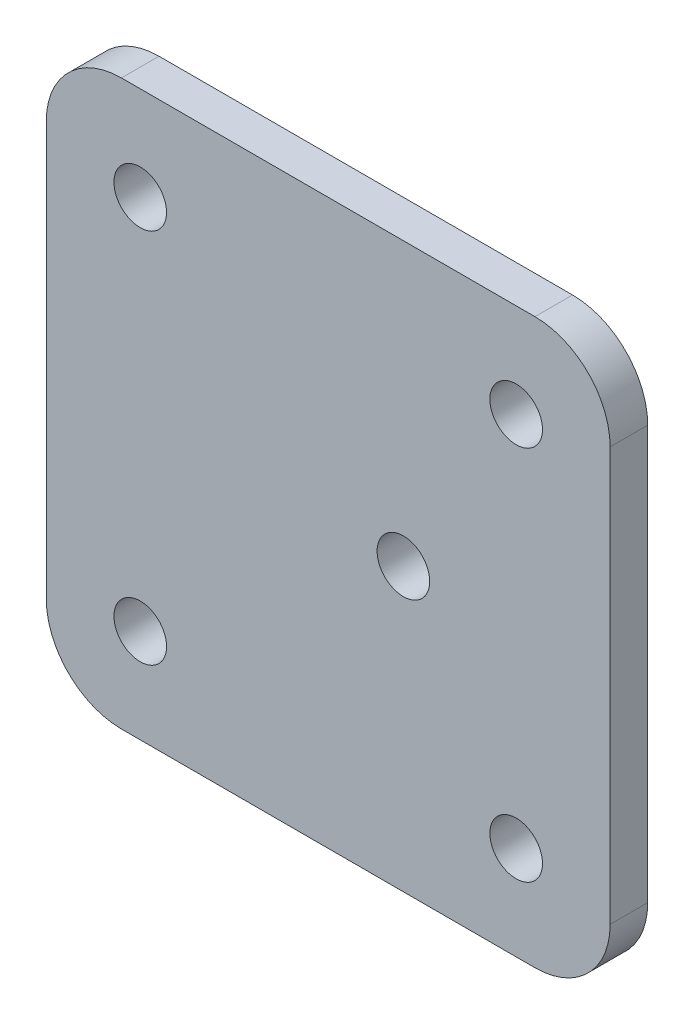
ISO-10303-21;
HEADER;
FILE_DESCRIPTION(('STEP AP214'),'2;1');
FILE_NAME('part.step','',(''),(''),'','','');
FILE_SCHEMA(('AUTOMOTIVE_DESIGN { 1 0 10303 214 1 1 1 1 }'));
ENDSEC;
DATA;
#1=APPLICATION_CONTEXT('core data for automotive mechanical design processes');
#2=APPLICATION_PROTOCOL_DEFINITION('international standard','automotive_design',2000,#1);
#3=PRODUCT_CONTEXT('',#1,'mechanical');
#4=PRODUCT('Part','Part','',(#3));
#5=PRODUCT_RELATED_PRODUCT_CATEGORY('part','',(#4));
#6=PRODUCT_DEFINITION_FORMATION('','',#4);
#7=PRODUCT_DEFINITION_CONTEXT('part definition',#1,'design');
#8=PRODUCT_DEFINITION('design','',#6,#7);
#9=PRODUCT_DEFINITION_SHAPE('','',#8);
#10=(LENGTH_UNIT() NAMED_UNIT(*) SI_UNIT(.MILLI.,.METRE.));
#11=(NAMED_UNIT(*) PLANE_ANGLE_UNIT() SI_UNIT($,.RADIAN.));
#12=(NAMED_UNIT(*) SI_UNIT($,.STERADIAN.) SOLID_ANGLE_UNIT());
#13=UNCERTAINTY_MEASURE_WITH_UNIT(LENGTH_MEASURE(1.E-05),#10,'distance_accuracy_value','');
#14=(GEOMETRIC_REPRESENTATION_CONTEXT(3) GLOBAL_UNCERTAINTY_ASSIGNED_CONTEXT((#13)) GLOBAL_UNIT_ASSIGNED_CONTEXT((#10,
#11,#12)) REPRESENTATION_CONTEXT('',''));
#15=CARTESIAN_POINT('',(0.,0.,0.));
#16=DIRECTION('',(0.,0.,1.));
#17=DIRECTION('',(1.,0.,0.));
#18=AXIS2_PLACEMENT_3D('',#15,#16,#17);
#19=CARTESIAN_POINT('',(-37.5,37.5,5.));
#20=DIRECTION('',(1.,0.,0.));
#21=DIRECTION('',(0.,1.,0.));
#22=AXIS2_PLACEMENT_3D('',#19,#20,#21);
#23=PLANE('',#22);
#24=DIRECTION('',(0.,-1.,0.));
#25=VECTOR('',#24,1.);
#26=CARTESIAN_POINT('',(-37.5,37.5,5.));
#27=LINE('',#26,#25);
#28=CARTESIAN_POINT('',(-37.5,27.5,5.));
#29=VERTEX_POINT('',#28);
#30=CARTESIAN_POINT('',(-37.5,-27.5,5.));
#31=VERTEX_POINT('',#30);
#32=EDGE_CURVE('E117',#29,#31,#27,.T.);
#33=ORIENTED_EDGE('',*,*,#32,.F.);
#34=DIRECTION('',(0.,0.,-1.));
#35=VECTOR('',#34,1.);
#36=CARTESIAN_POINT('',(-37.5,27.5,5.));
#37=LINE('',#36,#35);
#38=CARTESIAN_POINT('',(-37.5,27.5,0.));
#39=VERTEX_POINT('',#38);
#40=EDGE_CURVE('E102',#29,#39,#37,.T.);
#41=ORIENTED_EDGE('',*,*,#40,.T.);
#42=DIRECTION('',(0.,-1.,0.));
#43=VECTOR('',#42,1.);
#44=CARTESIAN_POINT('',(-37.5,37.5,0.));
#45=LINE('',#44,#43);
#46=CARTESIAN_POINT('',(-37.5,-27.5,0.));
#47=VERTEX_POINT('',#46);
#48=EDGE_CURVE('E114',#39,#47,#45,.T.);
#49=ORIENTED_EDGE('',*,*,#48,.T.);
#50=DIRECTION('',(0.,0.,-1.));
#51=VECTOR('',#50,1.);
#52=CARTESIAN_POINT('',(-37.5,-27.5,5.));
#53=LINE('',#52,#51);
#54=EDGE_CURVE('E119',#47,#31,#53,.F.);
#55=ORIENTED_EDGE('',*,*,#54,.T.);
#56=EDGE_LOOP('',(#33,#41,#49,#55));
#57=FACE_BOUND('',#56,.T.);
#58=ADVANCED_FACE('F32',(#57),#23,.F.);
#59=CARTESIAN_POINT('',(-37.5,-37.5,5.));
#60=DIRECTION('',(0.,1.,0.));
#61=DIRECTION('',(-1.,0.,0.));
#62=AXIS2_PLACEMENT_3D('',#59,#60,#61);
#63=PLANE('',#62);
#64=DIRECTION('',(1.,0.,0.));
#65=VECTOR('',#64,1.);
#66=CARTESIAN_POINT('',(-37.5,-37.5,5.));
#67=LINE('',#66,#65);
#68=CARTESIAN_POINT('',(-27.5,-37.5,5.));
#69=VERTEX_POINT('',#68);
#70=CARTESIAN_POINT('',(27.5,-37.5,5.));
#71=VERTEX_POINT('',#70);
#72=EDGE_CURVE('E163',#69,#71,#67,.T.);
#73=ORIENTED_EDGE('',*,*,#72,.F.);
#74=DIRECTION('',(0.,0.,-1.));
#75=VECTOR('',#74,1.);
#76=CARTESIAN_POINT('',(-27.5,-37.5,5.));
#77=LINE('',#76,#75);
#78=CARTESIAN_POINT('',(-27.5,-37.5,0.));
#79=VERTEX_POINT('',#78);
#80=EDGE_CURVE('E156',#69,#79,#77,.T.);
#81=ORIENTED_EDGE('',*,*,#80,.T.);
#82=DIRECTION('',(1.,0.,0.));
#83=VECTOR('',#82,1.);
#84=CARTESIAN_POINT('',(-37.5,-37.5,0.));
#85=LINE('',#84,#83);
#86=CARTESIAN_POINT('',(27.5,-37.5,0.));
#87=VERTEX_POINT('',#86);
#88=EDGE_CURVE('E123',#79,#87,#85,.T.);
#89=ORIENTED_EDGE('',*,*,#88,.T.);
#90=DIRECTION('',(0.,0.,-1.));
#91=VECTOR('',#90,1.);
#92=CARTESIAN_POINT('',(27.5,-37.5,5.));
#93=LINE('',#92,#91);
#94=EDGE_CURVE('E154',#87,#71,#93,.F.);
#95=ORIENTED_EDGE('',*,*,#94,.T.);
#96=EDGE_LOOP('',(#73,#81,#89,#95));
#97=FACE_BOUND('',#96,.T.);
#98=ADVANCED_FACE('F161',(#97),#63,.F.);
#99=CARTESIAN_POINT('',(37.5,37.5,5.));
#100=DIRECTION('',(-1.,0.,0.));
#101=DIRECTION('',(0.,0.,1.));
#102=AXIS2_PLACEMENT_3D('',#99,#100,#101);
#103=PLANE('',#102);
#104=DIRECTION('',(0.,1.,0.));
#105=VECTOR('',#104,1.);
#106=CARTESIAN_POINT('',(37.5,37.5,5.));
#107=LINE('',#106,#105);
#108=CARTESIAN_POINT('',(37.5,-27.5,5.));
#109=VERTEX_POINT('',#108);
#110=CARTESIAN_POINT('',(37.5,27.5,5.));
#111=VERTEX_POINT('',#110);
#112=EDGE_CURVE('E171',#109,#111,#107,.T.);
#113=ORIENTED_EDGE('',*,*,#112,.F.);
#114=DIRECTION('',(0.,0.,-1.));
#115=VECTOR('',#114,1.);
#116=CARTESIAN_POINT('',(37.5,-27.5,5.));
#117=LINE('',#116,#115);
#118=CARTESIAN_POINT('',(37.5,-27.5,0.));
#119=VERTEX_POINT('',#118);
#120=EDGE_CURVE('E11',#109,#119,#117,.T.);
#121=ORIENTED_EDGE('',*,*,#120,.T.);
#122=DIRECTION('',(0.,1.,0.));
#123=VECTOR('',#122,1.);
#124=CARTESIAN_POINT('',(37.5,37.5,0.));
#125=LINE('',#124,#123);
#126=CARTESIAN_POINT('',(37.5,27.5,0.));
#127=VERTEX_POINT('',#126);
#128=EDGE_CURVE('E127',#119,#127,#125,.T.);
#129=ORIENTED_EDGE('',*,*,#128,.T.);
#130=DIRECTION('',(0.,0.,-1.));
#131=VECTOR('',#130,1.);
#132=CARTESIAN_POINT('',(37.5,27.5,5.));
#133=LINE('',#132,#131);
#134=EDGE_CURVE('E40',#127,#111,#133,.F.);
#135=ORIENTED_EDGE('',*,*,#134,.T.);
#136=EDGE_LOOP('',(#113,#121,#129,#135));
#137=FACE_BOUND('',#136,.T.);
#138=ADVANCED_FACE('F170',(#137),#103,.F.);
#139=CARTESIAN_POINT('',(-37.5,37.5,5.));
#140=DIRECTION('',(0.,-1.,0.));
#141=DIRECTION('',(1.,0.,0.));
#142=AXIS2_PLACEMENT_3D('',#139,#140,#141);
#143=PLANE('',#142);
#144=DIRECTION('',(-1.,0.,0.));
#145=VECTOR('',#144,1.);
#146=CARTESIAN_POINT('',(-37.5,37.5,0.));
#147=LINE('',#146,#145);
#148=CARTESIAN_POINT('',(27.5,37.5,0.));
#149=VERTEX_POINT('',#148);
#150=CARTESIAN_POINT('',(-27.5,37.5,0.));
#151=VERTEX_POINT('',#150);
#152=EDGE_CURVE('E137',#149,#151,#147,.T.);
#153=ORIENTED_EDGE('',*,*,#152,.T.);
#154=DIRECTION('',(0.,0.,-1.));
#155=VECTOR('',#154,1.);
#156=CARTESIAN_POINT('',(-27.5,37.5,5.));
#157=LINE('',#156,#155);
#158=CARTESIAN_POINT('',(-27.5,37.5,5.));
#159=VERTEX_POINT('',#158);
#160=EDGE_CURVE('E103',#151,#159,#157,.F.);
#161=ORIENTED_EDGE('',*,*,#160,.T.);
#162=DIRECTION('',(-1.,0.,0.));
#163=VECTOR('',#162,1.);
#164=CARTESIAN_POINT('',(-37.5,37.5,5.));
#165=LINE('',#164,#163);
#166=CARTESIAN_POINT('',(27.5,37.5,5.));
#167=VERTEX_POINT('',#166);
#168=EDGE_CURVE('E133',#167,#159,#165,.T.);
#169=ORIENTED_EDGE('',*,*,#168,.F.);
#170=DIRECTION('',(0.,0.,-1.));
#171=VECTOR('',#170,1.);
#172=CARTESIAN_POINT('',(27.5,37.5,5.));
#173=LINE('',#172,#171);
#174=EDGE_CURVE('E108',#167,#149,#173,.T.);
#175=ORIENTED_EDGE('',*,*,#174,.T.);
#176=EDGE_LOOP('',(#153,#161,#169,#175));
#177=FACE_BOUND('',#176,.T.);
#178=ADVANCED_FACE('F209',(#177),#143,.F.);
#179=CARTESIAN_POINT('',(0.,0.,5.));
#180=DIRECTION('',(0.,0.,1.));
#181=DIRECTION('',(1.,0.,0.));
#182=AXIS2_PLACEMENT_3D('',#179,#180,#181);
#183=PLANE('',#182);
#184=CARTESIAN_POINT('',(10.,0.,5.));
#185=DIRECTION('',(0.,0.,1.));
#186=DIRECTION('',(1.,0.,0.));
#187=AXIS2_PLACEMENT_3D('',#184,#185,#186);
#188=CIRCLE('',#187,3.5);
#189=CARTESIAN_POINT('',(13.5,0.,5.));
#190=VERTEX_POINT('',#189);
#191=EDGE_CURVE('E200',#190,#190,#188,.T.);
#192=ORIENTED_EDGE('',*,*,#191,.F.);
#193=EDGE_LOOP('',(#192));
#194=FACE_BOUND('',#193,.T.);
#195=CARTESIAN_POINT('',(-25.,25.,5.));
#196=DIRECTION('',(0.,0.,1.));
#197=DIRECTION('',(1.,0.,0.));
#198=AXIS2_PLACEMENT_3D('',#195,#196,#197);
#199=CIRCLE('',#198,3.5);
#200=CARTESIAN_POINT('',(-21.5,25.,5.));
#201=VERTEX_POINT('',#200);
#202=EDGE_CURVE('E194',#201,#201,#199,.T.);
#203=ORIENTED_EDGE('',*,*,#202,.F.);
#204=EDGE_LOOP('',(#203));
#205=FACE_BOUND('',#204,.T.);
#206=CARTESIAN_POINT('',(-25.,-25.,5.));
#207=DIRECTION('',(0.,0.,1.));
#208=DIRECTION('',(1.,0.,0.));
#209=AXIS2_PLACEMENT_3D('',#206,#207,#208);
#210=CIRCLE('',#209,3.5);
#211=CARTESIAN_POINT('',(-21.5,-25.,5.));
#212=VERTEX_POINT('',#211);
#213=EDGE_CURVE('E188',#212,#212,#210,.T.);
#214=ORIENTED_EDGE('',*,*,#213,.F.);
#215=EDGE_LOOP('',(#214));
#216=FACE_BOUND('',#215,.T.);
#217=CARTESIAN_POINT('',(25.,-25.,5.));
#218=DIRECTION('',(0.,0.,1.));
#219=DIRECTION('',(1.,0.,0.));
#220=AXIS2_PLACEMENT_3D('',#217,#218,#219);
#221=CIRCLE('',#220,3.5);
#222=CARTESIAN_POINT('',(28.5,-25.,5.));
#223=VERTEX_POINT('',#222);
#224=EDGE_CURVE('E182',#223,#223,#221,.T.);
#225=ORIENTED_EDGE('',*,*,#224,.F.);
#226=EDGE_LOOP('',(#225));
#227=FACE_BOUND('',#226,.T.);
#228=CARTESIAN_POINT('',(25.,25.,5.));
#229=DIRECTION('',(0.,0.,1.));
#230=DIRECTION('',(1.,0.,0.));
#231=AXIS2_PLACEMENT_3D('',#228,#229,#230);
#232=CIRCLE('',#231,3.5);
#233=CARTESIAN_POINT('',(28.5,25.,5.));
#234=VERTEX_POINT('',#233);
#235=EDGE_CURVE('E130',#234,#234,#232,.T.);
#236=ORIENTED_EDGE('',*,*,#235,.F.);
#237=EDGE_LOOP('',(#236));
#238=FACE_BOUND('',#237,.T.);
#239=ORIENTED_EDGE('',*,*,#168,.T.);
#240=CARTESIAN_POINT('',(-27.5,27.5,5.));
#241=DIRECTION('',(0.,0.,1.));
#242=DIRECTION('',(1.,0.,0.));
#243=AXIS2_PLACEMENT_3D('',#240,#241,#242);
#244=CIRCLE('',#243,10.);
#245=EDGE_CURVE('E152',#159,#29,#244,.T.);
#246=ORIENTED_EDGE('',*,*,#245,.T.);
#247=ORIENTED_EDGE('',*,*,#32,.T.);
#248=CARTESIAN_POINT('',(-27.5,-27.5,5.));
#249=DIRECTION('',(0.,0.,1.));
#250=DIRECTION('',(1.,0.,0.));
#251=AXIS2_PLACEMENT_3D('',#248,#249,#250);
#252=CIRCLE('',#251,10.);
#253=EDGE_CURVE('E150',#31,#69,#252,.T.);
#254=ORIENTED_EDGE('',*,*,#253,.T.);
#255=ORIENTED_EDGE('',*,*,#72,.T.);
#256=CARTESIAN_POINT('',(27.5,-27.5,5.));
#257=DIRECTION('',(0.,0.,1.));
#258=DIRECTION('',(1.,0.,0.));
#259=AXIS2_PLACEMENT_3D('',#256,#257,#258);
#260=CIRCLE('',#259,10.);
#261=EDGE_CURVE('E53',#71,#109,#260,.T.);
#262=ORIENTED_EDGE('',*,*,#261,.T.);
#263=ORIENTED_EDGE('',*,*,#112,.T.);
#264=CARTESIAN_POINT('',(27.5,27.5,5.));
#265=DIRECTION('',(0.,0.,1.));
#266=DIRECTION('',(1.,0.,0.));
#267=AXIS2_PLACEMENT_3D('',#264,#265,#266);
#268=CIRCLE('',#267,10.);
#269=EDGE_CURVE('E147',#111,#167,#268,.T.);
#270=ORIENTED_EDGE('',*,*,#269,.T.);
#271=EDGE_LOOP('',(#239,#246,#247,#254,#255,#262,#263,#270));
#272=FACE_BOUND('',#271,.T.);
#273=ADVANCED_FACE('F206',(#194,#205,#216,#227,#238,#272),#183,.T.);
#274=CARTESIAN_POINT('',(0.,0.,0.));
#275=DIRECTION('',(0.,0.,1.));
#276=DIRECTION('',(1.,0.,0.));
#277=AXIS2_PLACEMENT_3D('',#274,#275,#276);
#278=PLANE('',#277);
#279=CARTESIAN_POINT('',(10.,0.,0.));
#280=DIRECTION('',(0.,0.,1.));
#281=DIRECTION('',(1.,0.,0.));
#282=AXIS2_PLACEMENT_3D('',#279,#280,#281);
#283=CIRCLE('',#282,3.5);
#284=CARTESIAN_POINT('',(13.5,0.,0.));
#285=VERTEX_POINT('',#284);
#286=EDGE_CURVE('E197',#285,#285,#283,.T.);
#287=ORIENTED_EDGE('',*,*,#286,.T.);
#288=EDGE_LOOP('',(#287));
#289=FACE_BOUND('',#288,.T.);
#290=CARTESIAN_POINT('',(-25.,25.,0.));
#291=DIRECTION('',(0.,0.,1.));
#292=DIRECTION('',(1.,0.,0.));
#293=AXIS2_PLACEMENT_3D('',#290,#291,#292);
#294=CIRCLE('',#293,3.5);
#295=CARTESIAN_POINT('',(-21.5,25.,0.));
#296=VERTEX_POINT('',#295);
#297=EDGE_CURVE('E191',#296,#296,#294,.T.);
#298=ORIENTED_EDGE('',*,*,#297,.T.);
#299=EDGE_LOOP('',(#298));
#300=FACE_BOUND('',#299,.T.);
#301=CARTESIAN_POINT('',(-25.,-25.,0.));
#302=DIRECTION('',(0.,0.,1.));
#303=DIRECTION('',(1.,0.,0.));
#304=AXIS2_PLACEMENT_3D('',#301,#302,#303);
#305=CIRCLE('',#304,3.5);
#306=CARTESIAN_POINT('',(-21.5,-25.,0.));
#307=VERTEX_POINT('',#306);
#308=EDGE_CURVE('E185',#307,#307,#305,.T.);
#309=ORIENTED_EDGE('',*,*,#308,.T.);
#310=EDGE_LOOP('',(#309));
#311=FACE_BOUND('',#310,.T.);
#312=CARTESIAN_POINT('',(25.,-25.,0.));
#313=DIRECTION('',(0.,0.,1.));
#314=DIRECTION('',(1.,0.,0.));
#315=AXIS2_PLACEMENT_3D('',#312,#313,#314);
#316=CIRCLE('',#315,3.5);
#317=CARTESIAN_POINT('',(28.5,-25.,0.));
#318=VERTEX_POINT('',#317);
#319=EDGE_CURVE('E179',#318,#318,#316,.T.);
#320=ORIENTED_EDGE('',*,*,#319,.T.);
#321=EDGE_LOOP('',(#320));
#322=FACE_BOUND('',#321,.T.);
#323=CARTESIAN_POINT('',(25.,25.,0.));
#324=DIRECTION('',(0.,0.,1.));
#325=DIRECTION('',(1.,0.,0.));
#326=AXIS2_PLACEMENT_3D('',#323,#324,#325);
#327=CIRCLE('',#326,3.5);
#328=CARTESIAN_POINT('',(28.5,25.,0.));
#329=VERTEX_POINT('',#328);
#330=EDGE_CURVE('E124',#329,#329,#327,.T.);
#331=ORIENTED_EDGE('',*,*,#330,.T.);
#332=EDGE_LOOP('',(#331));
#333=FACE_BOUND('',#332,.T.);
#334=ORIENTED_EDGE('',*,*,#48,.F.);
#335=CARTESIAN_POINT('',(-27.5,27.5,0.));
#336=DIRECTION('',(0.,0.,1.));
#337=DIRECTION('',(1.,0.,0.));
#338=AXIS2_PLACEMENT_3D('',#335,#336,#337);
#339=CIRCLE('',#338,10.);
#340=EDGE_CURVE('E98',#39,#151,#339,.F.);
#341=ORIENTED_EDGE('',*,*,#340,.T.);
#342=ORIENTED_EDGE('',*,*,#152,.F.);
#343=CARTESIAN_POINT('',(27.5,27.5,0.));
#344=DIRECTION('',(0.,0.,1.));
#345=DIRECTION('',(1.,0.,0.));
#346=AXIS2_PLACEMENT_3D('',#343,#344,#345);
#347=CIRCLE('',#346,10.);
#348=EDGE_CURVE('E118',#149,#127,#347,.F.);
#349=ORIENTED_EDGE('',*,*,#348,.T.);
#350=ORIENTED_EDGE('',*,*,#128,.F.);
#351=CARTESIAN_POINT('',(27.5,-27.5,0.));
#352=DIRECTION('',(0.,0.,1.));
#353=DIRECTION('',(1.,0.,0.));
#354=AXIS2_PLACEMENT_3D('',#351,#352,#353);
#355=CIRCLE('',#354,10.);
#356=EDGE_CURVE('E141',#119,#87,#355,.F.);
#357=ORIENTED_EDGE('',*,*,#356,.T.);
#358=ORIENTED_EDGE('',*,*,#88,.F.);
#359=CARTESIAN_POINT('',(-27.5,-27.5,0.));
#360=DIRECTION('',(0.,0.,1.));
#361=DIRECTION('',(1.,0.,0.));
#362=AXIS2_PLACEMENT_3D('',#359,#360,#361);
#363=CIRCLE('',#362,10.);
#364=EDGE_CURVE('E109',#79,#47,#363,.F.);
#365=ORIENTED_EDGE('',*,*,#364,.T.);
#366=EDGE_LOOP('',(#334,#341,#342,#349,#350,#357,#358,#365));
#367=FACE_BOUND('',#366,.T.);
#368=ADVANCED_FACE('F121',(#289,#300,#311,#322,#333,#367),#278,.F.);
#369=CARTESIAN_POINT('',(25.,25.,5.));
#370=DIRECTION('',(0.,0.,1.));
#371=DIRECTION('',(1.,0.,0.));
#372=AXIS2_PLACEMENT_3D('',#369,#370,#371);
#373=CYLINDRICAL_SURFACE('',#372,3.5);
#374=ORIENTED_EDGE('',*,*,#330,.F.);
#375=EDGE_LOOP('',(#374));
#376=FACE_BOUND('',#375,.T.);
#377=ORIENTED_EDGE('',*,*,#235,.T.);
#378=EDGE_LOOP('',(#377));
#379=FACE_BOUND('',#378,.T.);
#380=ADVANCED_FACE('F273',(#376,#379),#373,.F.);
#381=CARTESIAN_POINT('',(25.,-25.,5.));
#382=DIRECTION('',(0.,0.,1.));
#383=DIRECTION('',(1.,0.,0.));
#384=AXIS2_PLACEMENT_3D('',#381,#382,#383);
#385=CYLINDRICAL_SURFACE('',#384,3.5);
#386=ORIENTED_EDGE('',*,*,#319,.F.);
#387=EDGE_LOOP('',(#386));
#388=FACE_BOUND('',#387,.T.);
#389=ORIENTED_EDGE('',*,*,#224,.T.);
#390=EDGE_LOOP('',(#389));
#391=FACE_BOUND('',#390,.T.);
#392=ADVANCED_FACE('F288',(#388,#391),#385,.F.);
#393=CARTESIAN_POINT('',(-25.,-25.,5.));
#394=DIRECTION('',(0.,0.,1.));
#395=DIRECTION('',(1.,0.,0.));
#396=AXIS2_PLACEMENT_3D('',#393,#394,#395);
#397=CYLINDRICAL_SURFACE('',#396,3.5);
#398=ORIENTED_EDGE('',*,*,#308,.F.);
#399=EDGE_LOOP('',(#398));
#400=FACE_BOUND('',#399,.T.);
#401=ORIENTED_EDGE('',*,*,#213,.T.);
#402=EDGE_LOOP('',(#401));
#403=FACE_BOUND('',#402,.T.);
#404=ADVANCED_FACE('F295',(#400,#403),#397,.F.);
#405=CARTESIAN_POINT('',(-25.,25.,5.));
#406=DIRECTION('',(0.,0.,1.));
#407=DIRECTION('',(1.,0.,0.));
#408=AXIS2_PLACEMENT_3D('',#405,#406,#407);
#409=CYLINDRICAL_SURFACE('',#408,3.5);
#410=ORIENTED_EDGE('',*,*,#297,.F.);
#411=EDGE_LOOP('',(#410));
#412=FACE_BOUND('',#411,.T.);
#413=ORIENTED_EDGE('',*,*,#202,.T.);
#414=EDGE_LOOP('',(#413));
#415=FACE_BOUND('',#414,.T.);
#416=ADVANCED_FACE('F240',(#412,#415),#409,.F.);
#417=CARTESIAN_POINT('',(-27.5,27.5,5.));
#418=DIRECTION('',(0.,0.,-1.));
#419=DIRECTION('',(-1.,0.,0.));
#420=AXIS2_PLACEMENT_3D('',#417,#418,#419);
#421=CYLINDRICAL_SURFACE('',#420,10.);
#422=ORIENTED_EDGE('',*,*,#245,.F.);
#423=ORIENTED_EDGE('',*,*,#160,.F.);
#424=ORIENTED_EDGE('',*,*,#340,.F.);
#425=ORIENTED_EDGE('',*,*,#40,.F.);
#426=EDGE_LOOP('',(#422,#423,#424,#425));
#427=FACE_BOUND('',#426,.T.);
#428=ADVANCED_FACE('F101',(#427),#421,.T.);
#429=CARTESIAN_POINT('',(-27.5,-27.5,5.));
#430=DIRECTION('',(0.,0.,-1.));
#431=DIRECTION('',(-1.,0.,0.));
#432=AXIS2_PLACEMENT_3D('',#429,#430,#431);
#433=CYLINDRICAL_SURFACE('',#432,10.);
#434=ORIENTED_EDGE('',*,*,#253,.F.);
#435=ORIENTED_EDGE('',*,*,#54,.F.);
#436=ORIENTED_EDGE('',*,*,#364,.F.);
#437=ORIENTED_EDGE('',*,*,#80,.F.);
#438=EDGE_LOOP('',(#434,#435,#436,#437));
#439=FACE_BOUND('',#438,.T.);
#440=ADVANCED_FACE('F229',(#439),#433,.T.);
#441=CARTESIAN_POINT('',(27.5,-27.5,5.));
#442=DIRECTION('',(0.,0.,-1.));
#443=DIRECTION('',(-1.,0.,0.));
#444=AXIS2_PLACEMENT_3D('',#441,#442,#443);
#445=CYLINDRICAL_SURFACE('',#444,10.);
#446=ORIENTED_EDGE('',*,*,#261,.F.);
#447=ORIENTED_EDGE('',*,*,#94,.F.);
#448=ORIENTED_EDGE('',*,*,#356,.F.);
#449=ORIENTED_EDGE('',*,*,#120,.F.);
#450=EDGE_LOOP('',(#446,#447,#448,#449));
#451=FACE_BOUND('',#450,.T.);
#452=ADVANCED_FACE('F169',(#451),#445,.T.);
#453=CARTESIAN_POINT('',(27.5,27.5,5.));
#454=DIRECTION('',(0.,0.,-1.));
#455=DIRECTION('',(-1.,0.,0.));
#456=AXIS2_PLACEMENT_3D('',#453,#454,#455);
#457=CYLINDRICAL_SURFACE('',#456,10.);
#458=ORIENTED_EDGE('',*,*,#269,.F.);
#459=ORIENTED_EDGE('',*,*,#134,.F.);
#460=ORIENTED_EDGE('',*,*,#348,.F.);
#461=ORIENTED_EDGE('',*,*,#174,.F.);
#462=EDGE_LOOP('',(#458,#459,#460,#461));
#463=FACE_BOUND('',#462,.T.);
#464=ADVANCED_FACE('F34',(#463),#457,.T.);
#465=CARTESIAN_POINT('',(10.,0.,5.));
#466=DIRECTION('',(0.,0.,1.));
#467=DIRECTION('',(1.,0.,0.));
#468=AXIS2_PLACEMENT_3D('',#465,#466,#467);
#469=CYLINDRICAL_SURFACE('',#468,3.5);
#470=ORIENTED_EDGE('',*,*,#286,.F.);
#471=EDGE_LOOP('',(#470));
#472=FACE_BOUND('',#471,.T.);
#473=ORIENTED_EDGE('',*,*,#191,.T.);
#474=EDGE_LOOP('',(#473));
#475=FACE_BOUND('',#474,.T.);
#476=ADVANCED_FACE('F204',(#472,#475),#469,.F.);
#477=CLOSED_SHELL('',(#58,#98,#138,#178,#273,#368,#380,#392,#404,#416,#428,#440,#452,#464,#476));
#478=MANIFOLD_SOLID_BREP('B2',#477);
#479=ADVANCED_BREP_SHAPE_REPRESENTATION('',(#18,#478),#14);
#480=SHAPE_DEFINITION_REPRESENTATION(#9,#479);
ENDSEC;
END-ISO-10303-21;
